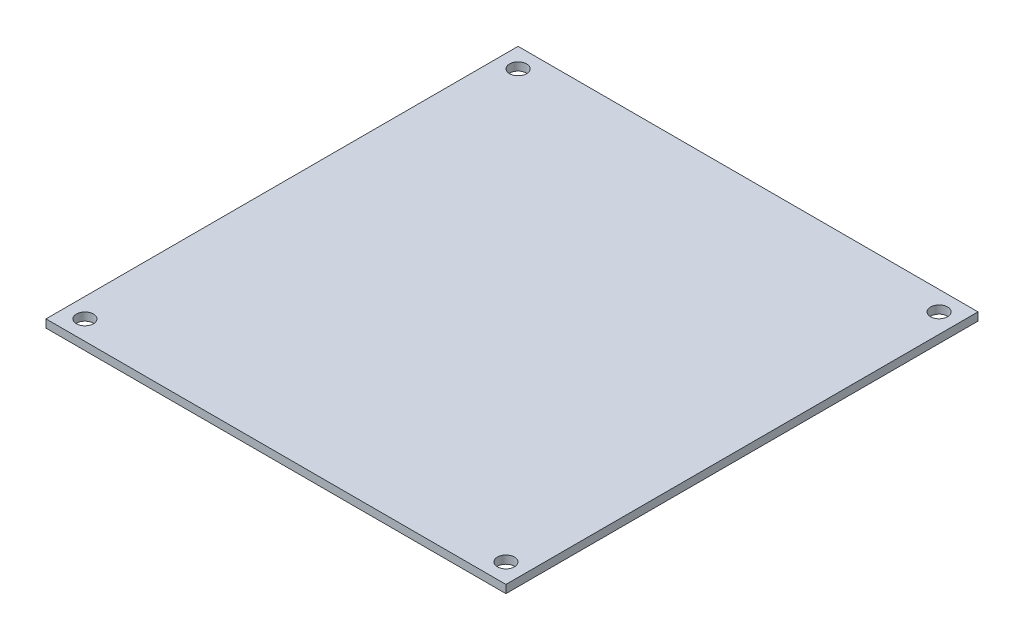
ISO-10303-21;
HEADER;
FILE_DESCRIPTION(('STEP AP214'),'2;1');
FILE_NAME('part.step','',(''),(''),'','','');
FILE_SCHEMA(('AUTOMOTIVE_DESIGN { 1 0 10303 214 1 1 1 1 }'));
ENDSEC;
DATA;
#1=APPLICATION_CONTEXT('core data for automotive mechanical design processes');
#2=APPLICATION_PROTOCOL_DEFINITION('international standard','automotive_design',2000,#1);
#3=PRODUCT_CONTEXT('',#1,'mechanical');
#4=PRODUCT('Part','Part','',(#3));
#5=PRODUCT_RELATED_PRODUCT_CATEGORY('part','',(#4));
#6=PRODUCT_DEFINITION_FORMATION('','',#4);
#7=PRODUCT_DEFINITION_CONTEXT('part definition',#1,'design');
#8=PRODUCT_DEFINITION('design','',#6,#7);
#9=PRODUCT_DEFINITION_SHAPE('','',#8);
#10=(LENGTH_UNIT() NAMED_UNIT(*) SI_UNIT(.MILLI.,.METRE.));
#11=(NAMED_UNIT(*) PLANE_ANGLE_UNIT() SI_UNIT($,.RADIAN.));
#12=(NAMED_UNIT(*) SI_UNIT($,.STERADIAN.) SOLID_ANGLE_UNIT());
#13=UNCERTAINTY_MEASURE_WITH_UNIT(LENGTH_MEASURE(1.E-05),#10,'distance_accuracy_value','');
#14=(GEOMETRIC_REPRESENTATION_CONTEXT(3) GLOBAL_UNCERTAINTY_ASSIGNED_CONTEXT((#13)) GLOBAL_UNIT_ASSIGNED_CONTEXT((#10,
#11,#12)) REPRESENTATION_CONTEXT('',''));
#15=CARTESIAN_POINT('',(0.,0.,0.));
#16=DIRECTION('',(0.,0.,1.));
#17=DIRECTION('',(1.,0.,0.));
#18=AXIS2_PLACEMENT_3D('',#15,#16,#17);
#19=CARTESIAN_POINT('',(0.,1.65,0.));
#20=DIRECTION('',(1.,0.,0.));
#21=DIRECTION('',(0.,0.,-1.));
#22=AXIS2_PLACEMENT_3D('',#19,#20,#21);
#23=PLANE('',#22);
#24=DIRECTION('',(0.,0.,1.));
#25=VECTOR('',#24,1.);
#26=CARTESIAN_POINT('',(0.,0.,0.));
#27=LINE('',#26,#25);
#28=CARTESIAN_POINT('',(0.,0.,-97.));
#29=VERTEX_POINT('',#28);
#30=CARTESIAN_POINT('',(0.,0.,0.));
#31=VERTEX_POINT('',#30);
#32=EDGE_CURVE('E103',#29,#31,#27,.T.);
#33=ORIENTED_EDGE('',*,*,#32,.T.);
#34=DIRECTION('',(0.,-1.,0.));
#35=VECTOR('',#34,1.);
#36=CARTESIAN_POINT('',(0.,1.65,0.));
#37=LINE('',#36,#35);
#38=CARTESIAN_POINT('',(0.,1.65,0.));
#39=VERTEX_POINT('',#38);
#40=EDGE_CURVE('E11',#39,#31,#37,.T.);
#41=ORIENTED_EDGE('',*,*,#40,.F.);
#42=DIRECTION('',(0.,0.,1.));
#43=VECTOR('',#42,1.);
#44=CARTESIAN_POINT('',(0.,1.65,0.));
#45=LINE('',#44,#43);
#46=CARTESIAN_POINT('',(0.,1.65,-97.));
#47=VERTEX_POINT('',#46);
#48=EDGE_CURVE('E91',#47,#39,#45,.T.);
#49=ORIENTED_EDGE('',*,*,#48,.F.);
#50=DIRECTION('',(0.,-1.,0.));
#51=VECTOR('',#50,1.);
#52=CARTESIAN_POINT('',(0.,1.65,-97.));
#53=LINE('',#52,#51);
#54=EDGE_CURVE('E99',#47,#29,#53,.T.);
#55=ORIENTED_EDGE('',*,*,#54,.T.);
#56=EDGE_LOOP('',(#33,#41,#49,#55));
#57=FACE_BOUND('',#56,.T.);
#58=ADVANCED_FACE('F40',(#57),#23,.F.);
#59=CARTESIAN_POINT('',(0.,1.65,0.));
#60=DIRECTION('',(0.,0.,-1.));
#61=DIRECTION('',(-1.,0.,0.));
#62=AXIS2_PLACEMENT_3D('',#59,#60,#61);
#63=PLANE('',#62);
#64=DIRECTION('',(1.,0.,0.));
#65=VECTOR('',#64,1.);
#66=CARTESIAN_POINT('',(0.,0.,0.));
#67=LINE('',#66,#65);
#68=CARTESIAN_POINT('',(94.5,0.,0.));
#69=VERTEX_POINT('',#68);
#70=EDGE_CURVE('E95',#31,#69,#67,.T.);
#71=ORIENTED_EDGE('',*,*,#70,.T.);
#72=DIRECTION('',(0.,-1.,0.));
#73=VECTOR('',#72,1.);
#74=CARTESIAN_POINT('',(94.5,1.65,0.));
#75=LINE('',#74,#73);
#76=CARTESIAN_POINT('',(94.5,1.65,0.));
#77=VERTEX_POINT('',#76);
#78=EDGE_CURVE('E48',#77,#69,#75,.T.);
#79=ORIENTED_EDGE('',*,*,#78,.F.);
#80=DIRECTION('',(1.,0.,0.));
#81=VECTOR('',#80,1.);
#82=CARTESIAN_POINT('',(0.,1.65,0.));
#83=LINE('',#82,#81);
#84=EDGE_CURVE('E86',#39,#77,#83,.T.);
#85=ORIENTED_EDGE('',*,*,#84,.F.);
#86=ORIENTED_EDGE('',*,*,#40,.T.);
#87=EDGE_LOOP('',(#71,#79,#85,#86));
#88=FACE_BOUND('',#87,.T.);
#89=ADVANCED_FACE('F94',(#88),#63,.F.);
#90=CARTESIAN_POINT('',(94.5,1.65,0.));
#91=DIRECTION('',(-1.,0.,0.));
#92=DIRECTION('',(0.,0.,1.));
#93=AXIS2_PLACEMENT_3D('',#90,#91,#92);
#94=PLANE('',#93);
#95=DIRECTION('',(0.,0.,-1.));
#96=VECTOR('',#95,1.);
#97=CARTESIAN_POINT('',(94.5,0.,0.));
#98=LINE('',#97,#96);
#99=CARTESIAN_POINT('',(94.5,0.,-97.));
#100=VERTEX_POINT('',#99);
#101=EDGE_CURVE('E73',#69,#100,#98,.T.);
#102=ORIENTED_EDGE('',*,*,#101,.T.);
#103=DIRECTION('',(0.,-1.,0.));
#104=VECTOR('',#103,1.);
#105=CARTESIAN_POINT('',(94.5,1.65,-97.));
#106=LINE('',#105,#104);
#107=CARTESIAN_POINT('',(94.5,1.65,-97.));
#108=VERTEX_POINT('',#107);
#109=EDGE_CURVE('E96',#108,#100,#106,.T.);
#110=ORIENTED_EDGE('',*,*,#109,.F.);
#111=DIRECTION('',(0.,0.,-1.));
#112=VECTOR('',#111,1.);
#113=CARTESIAN_POINT('',(94.5,1.65,0.));
#114=LINE('',#113,#112);
#115=EDGE_CURVE('E89',#77,#108,#114,.T.);
#116=ORIENTED_EDGE('',*,*,#115,.F.);
#117=ORIENTED_EDGE('',*,*,#78,.T.);
#118=EDGE_LOOP('',(#102,#110,#116,#117));
#119=FACE_BOUND('',#118,.T.);
#120=ADVANCED_FACE('F97',(#119),#94,.F.);
#121=CARTESIAN_POINT('',(0.,1.65,-97.));
#122=DIRECTION('',(0.,0.,1.));
#123=DIRECTION('',(1.,0.,0.));
#124=AXIS2_PLACEMENT_3D('',#121,#122,#123);
#125=PLANE('',#124);
#126=DIRECTION('',(-1.,0.,0.));
#127=VECTOR('',#126,1.);
#128=CARTESIAN_POINT('',(0.,0.,-97.));
#129=LINE('',#128,#127);
#130=EDGE_CURVE('E79',#100,#29,#129,.T.);
#131=ORIENTED_EDGE('',*,*,#130,.T.);
#132=ORIENTED_EDGE('',*,*,#54,.F.);
#133=DIRECTION('',(-1.,0.,0.));
#134=VECTOR('',#133,1.);
#135=CARTESIAN_POINT('',(0.,1.65,-97.));
#136=LINE('',#135,#134);
#137=EDGE_CURVE('E56',#108,#47,#136,.T.);
#138=ORIENTED_EDGE('',*,*,#137,.F.);
#139=ORIENTED_EDGE('',*,*,#109,.T.);
#140=EDGE_LOOP('',(#131,#132,#138,#139));
#141=FACE_BOUND('',#140,.T.);
#142=ADVANCED_FACE('F111',(#141),#125,.F.);
#143=CARTESIAN_POINT('',(0.,1.65,0.));
#144=DIRECTION('',(0.,-1.,0.));
#145=DIRECTION('',(0.,0.,-1.));
#146=AXIS2_PLACEMENT_3D('',#143,#144,#145);
#147=PLANE('',#146);
#148=CARTESIAN_POINT('',(4.,1.65,-4.));
#149=DIRECTION('',(0.,1.,0.));
#150=DIRECTION('',(0.,0.,1.));
#151=AXIS2_PLACEMENT_3D('',#148,#149,#150);
#152=CIRCLE('',#151,1.75);
#153=CARTESIAN_POINT('',(4.,1.65,-2.25));
#154=VERTEX_POINT('',#153);
#155=EDGE_CURVE('E126',#154,#154,#152,.T.);
#156=ORIENTED_EDGE('',*,*,#155,.F.);
#157=EDGE_LOOP('',(#156));
#158=FACE_BOUND('',#157,.T.);
#159=CARTESIAN_POINT('',(90.5,1.65,-4.));
#160=DIRECTION('',(0.,1.,0.));
#161=DIRECTION('',(0.,0.,1.));
#162=AXIS2_PLACEMENT_3D('',#159,#160,#161);
#163=CIRCLE('',#162,1.75);
#164=CARTESIAN_POINT('',(90.5,1.65,-2.25));
#165=VERTEX_POINT('',#164);
#166=EDGE_CURVE('E132',#165,#165,#163,.T.);
#167=ORIENTED_EDGE('',*,*,#166,.F.);
#168=EDGE_LOOP('',(#167));
#169=FACE_BOUND('',#168,.T.);
#170=CARTESIAN_POINT('',(90.5,1.65,-93.));
#171=DIRECTION('',(0.,1.,0.));
#172=DIRECTION('',(0.,0.,1.));
#173=AXIS2_PLACEMENT_3D('',#170,#171,#172);
#174=CIRCLE('',#173,1.75);
#175=CARTESIAN_POINT('',(90.5,1.65,-91.25));
#176=VERTEX_POINT('',#175);
#177=EDGE_CURVE('E120',#176,#176,#174,.T.);
#178=ORIENTED_EDGE('',*,*,#177,.F.);
#179=EDGE_LOOP('',(#178));
#180=FACE_BOUND('',#179,.T.);
#181=CARTESIAN_POINT('',(4.,1.65,-93.));
#182=DIRECTION('',(0.,1.,0.));
#183=DIRECTION('',(0.,0.,1.));
#184=AXIS2_PLACEMENT_3D('',#181,#182,#183);
#185=CIRCLE('',#184,1.75);
#186=CARTESIAN_POINT('',(4.,1.65,-91.25));
#187=VERTEX_POINT('',#186);
#188=EDGE_CURVE('E117',#187,#187,#185,.T.);
#189=ORIENTED_EDGE('',*,*,#188,.F.);
#190=EDGE_LOOP('',(#189));
#191=FACE_BOUND('',#190,.T.);
#192=ORIENTED_EDGE('',*,*,#48,.T.);
#193=ORIENTED_EDGE('',*,*,#84,.T.);
#194=ORIENTED_EDGE('',*,*,#115,.T.);
#195=ORIENTED_EDGE('',*,*,#137,.T.);
#196=EDGE_LOOP('',(#192,#193,#194,#195));
#197=FACE_BOUND('',#196,.T.);
#198=ADVANCED_FACE('F87',(#158,#169,#180,#191,#197),#147,.F.);
#199=CARTESIAN_POINT('',(0.,0.,0.));
#200=DIRECTION('',(0.,-1.,0.));
#201=DIRECTION('',(0.,0.,-1.));
#202=AXIS2_PLACEMENT_3D('',#199,#200,#201);
#203=PLANE('',#202);
#204=CARTESIAN_POINT('',(4.,0.,-4.));
#205=DIRECTION('',(0.,1.,0.));
#206=DIRECTION('',(0.,0.,1.));
#207=AXIS2_PLACEMENT_3D('',#204,#205,#206);
#208=CIRCLE('',#207,1.75);
#209=CARTESIAN_POINT('',(4.,0.,-2.25));
#210=VERTEX_POINT('',#209);
#211=EDGE_CURVE('E123',#210,#210,#208,.T.);
#212=ORIENTED_EDGE('',*,*,#211,.T.);
#213=EDGE_LOOP('',(#212));
#214=FACE_BOUND('',#213,.T.);
#215=CARTESIAN_POINT('',(90.5,0.,-4.));
#216=DIRECTION('',(0.,1.,0.));
#217=DIRECTION('',(0.,0.,1.));
#218=AXIS2_PLACEMENT_3D('',#215,#216,#217);
#219=CIRCLE('',#218,1.75);
#220=CARTESIAN_POINT('',(90.5,0.,-2.25));
#221=VERTEX_POINT('',#220);
#222=EDGE_CURVE('E129',#221,#221,#219,.T.);
#223=ORIENTED_EDGE('',*,*,#222,.T.);
#224=EDGE_LOOP('',(#223));
#225=FACE_BOUND('',#224,.T.);
#226=CARTESIAN_POINT('',(90.5,0.,-93.));
#227=DIRECTION('',(0.,1.,0.));
#228=DIRECTION('',(0.,0.,1.));
#229=AXIS2_PLACEMENT_3D('',#226,#227,#228);
#230=CIRCLE('',#229,1.75);
#231=CARTESIAN_POINT('',(90.5,0.,-91.25));
#232=VERTEX_POINT('',#231);
#233=EDGE_CURVE('E135',#232,#232,#230,.T.);
#234=ORIENTED_EDGE('',*,*,#233,.T.);
#235=EDGE_LOOP('',(#234));
#236=FACE_BOUND('',#235,.T.);
#237=CARTESIAN_POINT('',(4.,0.,-93.));
#238=DIRECTION('',(0.,1.,0.));
#239=DIRECTION('',(0.,0.,1.));
#240=AXIS2_PLACEMENT_3D('',#237,#238,#239);
#241=CIRCLE('',#240,1.75);
#242=CARTESIAN_POINT('',(4.,0.,-91.25));
#243=VERTEX_POINT('',#242);
#244=EDGE_CURVE('E106',#243,#243,#241,.T.);
#245=ORIENTED_EDGE('',*,*,#244,.T.);
#246=EDGE_LOOP('',(#245));
#247=FACE_BOUND('',#246,.T.);
#248=ORIENTED_EDGE('',*,*,#32,.F.);
#249=ORIENTED_EDGE('',*,*,#130,.F.);
#250=ORIENTED_EDGE('',*,*,#101,.F.);
#251=ORIENTED_EDGE('',*,*,#70,.F.);
#252=EDGE_LOOP('',(#248,#249,#250,#251));
#253=FACE_BOUND('',#252,.T.);
#254=ADVANCED_FACE('F114',(#214,#225,#236,#247,#253),#203,.T.);
#255=CARTESIAN_POINT('',(4.,0.,-93.));
#256=DIRECTION('',(0.,1.,0.));
#257=DIRECTION('',(0.,0.,1.));
#258=AXIS2_PLACEMENT_3D('',#255,#256,#257);
#259=CYLINDRICAL_SURFACE('',#258,1.75);
#260=ORIENTED_EDGE('',*,*,#244,.F.);
#261=EDGE_LOOP('',(#260));
#262=FACE_BOUND('',#261,.T.);
#263=ORIENTED_EDGE('',*,*,#188,.T.);
#264=EDGE_LOOP('',(#263));
#265=FACE_BOUND('',#264,.T.);
#266=ADVANCED_FACE('F149',(#262,#265),#259,.F.);
#267=CARTESIAN_POINT('',(90.5,0.,-93.));
#268=DIRECTION('',(0.,1.,0.));
#269=DIRECTION('',(0.,0.,1.));
#270=AXIS2_PLACEMENT_3D('',#267,#268,#269);
#271=CYLINDRICAL_SURFACE('',#270,1.75);
#272=ORIENTED_EDGE('',*,*,#233,.F.);
#273=EDGE_LOOP('',(#272));
#274=FACE_BOUND('',#273,.T.);
#275=ORIENTED_EDGE('',*,*,#177,.T.);
#276=EDGE_LOOP('',(#275));
#277=FACE_BOUND('',#276,.T.);
#278=ADVANCED_FACE('F141',(#274,#277),#271,.F.);
#279=CARTESIAN_POINT('',(90.5,0.,-4.));
#280=DIRECTION('',(0.,1.,0.));
#281=DIRECTION('',(0.,0.,1.));
#282=AXIS2_PLACEMENT_3D('',#279,#280,#281);
#283=CYLINDRICAL_SURFACE('',#282,1.75);
#284=ORIENTED_EDGE('',*,*,#222,.F.);
#285=EDGE_LOOP('',(#284));
#286=FACE_BOUND('',#285,.T.);
#287=ORIENTED_EDGE('',*,*,#166,.T.);
#288=EDGE_LOOP('',(#287));
#289=FACE_BOUND('',#288,.T.);
#290=ADVANCED_FACE('F157',(#286,#289),#283,.F.);
#291=CARTESIAN_POINT('',(4.,0.,-4.));
#292=DIRECTION('',(0.,1.,0.));
#293=DIRECTION('',(0.,0.,1.));
#294=AXIS2_PLACEMENT_3D('',#291,#292,#293);
#295=CYLINDRICAL_SURFACE('',#294,1.75);
#296=ORIENTED_EDGE('',*,*,#211,.F.);
#297=EDGE_LOOP('',(#296));
#298=FACE_BOUND('',#297,.T.);
#299=ORIENTED_EDGE('',*,*,#155,.T.);
#300=EDGE_LOOP('',(#299));
#301=FACE_BOUND('',#300,.T.);
#302=ADVANCED_FACE('F208',(#298,#301),#295,.F.);
#303=CLOSED_SHELL('',(#58,#89,#120,#142,#198,#254,#266,#278,#290,#302));
#304=MANIFOLD_SOLID_BREP('B2',#303);
#305=ADVANCED_BREP_SHAPE_REPRESENTATION('',(#18,#304),#14);
#306=SHAPE_DEFINITION_REPRESENTATION(#9,#305);
ENDSEC;
END-ISO-10303-21;
